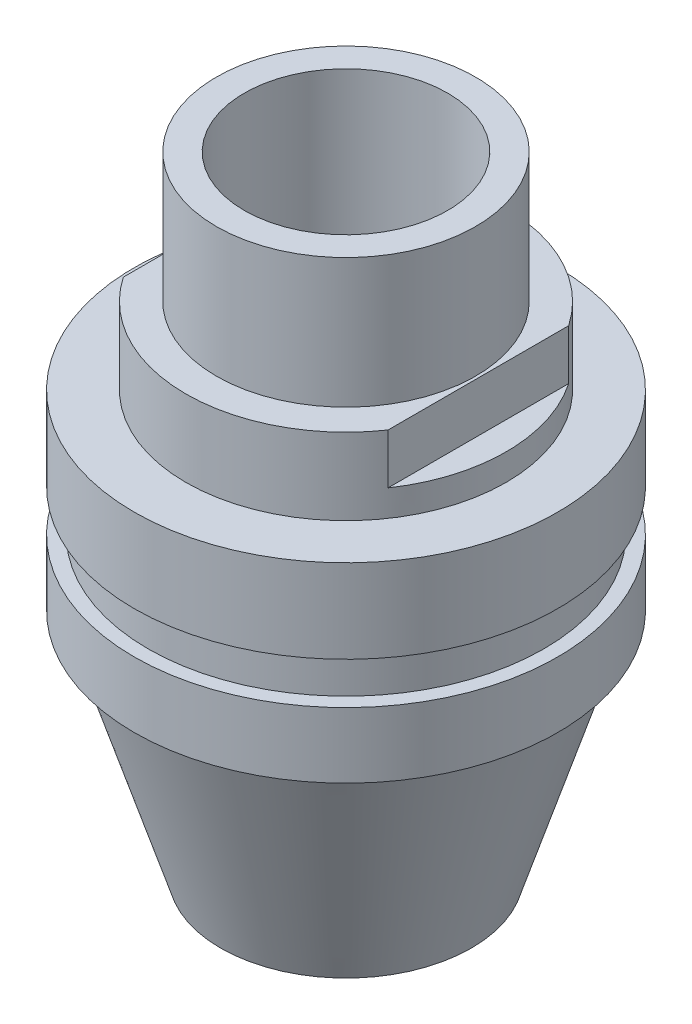
ISO-10303-21;
HEADER;
FILE_DESCRIPTION(('STEP AP214'),'2;1');
FILE_NAME('part.step','',(''),(''),'','','');
FILE_SCHEMA(('AUTOMOTIVE_DESIGN { 1 0 10303 214 1 1 1 1 }'));
ENDSEC;
DATA;
#1=APPLICATION_CONTEXT('core data for automotive mechanical design processes');
#2=APPLICATION_PROTOCOL_DEFINITION('international standard','automotive_design',2000,#1);
#3=PRODUCT_CONTEXT('',#1,'mechanical');
#4=PRODUCT('Part','Part','',(#3));
#5=PRODUCT_RELATED_PRODUCT_CATEGORY('part','',(#4));
#6=PRODUCT_DEFINITION_FORMATION('','',#4);
#7=PRODUCT_DEFINITION_CONTEXT('part definition',#1,'design');
#8=PRODUCT_DEFINITION('design','',#6,#7);
#9=PRODUCT_DEFINITION_SHAPE('','',#8);
#10=(LENGTH_UNIT() NAMED_UNIT(*) SI_UNIT(.MILLI.,.METRE.));
#11=(NAMED_UNIT(*) PLANE_ANGLE_UNIT() SI_UNIT($,.RADIAN.));
#12=(NAMED_UNIT(*) SI_UNIT($,.STERADIAN.) SOLID_ANGLE_UNIT());
#13=UNCERTAINTY_MEASURE_WITH_UNIT(LENGTH_MEASURE(1.E-05),#10,'distance_accuracy_value','');
#14=(GEOMETRIC_REPRESENTATION_CONTEXT(3) GLOBAL_UNCERTAINTY_ASSIGNED_CONTEXT((#13)) GLOBAL_UNIT_ASSIGNED_CONTEXT((#10,
#11,#12)) REPRESENTATION_CONTEXT('',''));
#15=CARTESIAN_POINT('',(0.,0.,0.));
#16=DIRECTION('',(0.,0.,1.));
#17=DIRECTION('',(1.,0.,0.));
#18=AXIS2_PLACEMENT_3D('',#15,#16,#17);
#19=CARTESIAN_POINT('',(0.,0.,0.));
#20=DIRECTION('',(0.,-1.,0.));
#21=DIRECTION('',(0.,0.,-1.));
#22=AXIS2_PLACEMENT_3D('',#19,#20,#21);
#23=PLANE('',#22);
#24=CARTESIAN_POINT('',(0.,0.,0.));
#25=DIRECTION('',(0.,1.,0.));
#26=DIRECTION('',(0.,0.,1.));
#27=AXIS2_PLACEMENT_3D('',#24,#25,#26);
#28=CIRCLE('',#27,4.65);
#29=CARTESIAN_POINT('',(0.,0.,4.65));
#30=VERTEX_POINT('',#29);
#31=EDGE_CURVE('E11',#30,#30,#28,.T.);
#32=ORIENTED_EDGE('',*,*,#31,.T.);
#33=EDGE_LOOP('',(#32));
#34=FACE_BOUND('',#33,.T.);
#35=CARTESIAN_POINT('',(0.,0.,0.));
#36=DIRECTION('',(0.,-1.,0.));
#37=DIRECTION('',(0.,0.,-1.));
#38=AXIS2_PLACEMENT_3D('',#35,#36,#37);
#39=CIRCLE('',#38,3.65);
#40=CARTESIAN_POINT('',(0.,0.,-3.65));
#41=VERTEX_POINT('',#40);
#42=EDGE_CURVE('E127',#41,#41,#39,.F.);
#43=ORIENTED_EDGE('',*,*,#42,.F.);
#44=EDGE_LOOP('',(#43));
#45=FACE_BOUND('',#44,.T.);
#46=ADVANCED_FACE('F32',(#34,#45),#23,.F.);
#47=CARTESIAN_POINT('',(4.65,-4.65,0.));
#48=DIRECTION('',(0.,-1.,0.));
#49=DIRECTION('',(0.,0.,-1.));
#50=AXIS2_PLACEMENT_3D('',#47,#48,#49);
#51=PLANE('',#50);
#52=CARTESIAN_POINT('',(0.,-4.65,0.));
#53=DIRECTION('',(0.,1.,0.));
#54=DIRECTION('',(0.,0.,1.));
#55=AXIS2_PLACEMENT_3D('',#52,#53,#54);
#56=CIRCLE('',#55,4.65);
#57=CARTESIAN_POINT('',(0.,-4.65,4.65));
#58=VERTEX_POINT('',#57);
#59=EDGE_CURVE('E40',#58,#58,#56,.T.);
#60=ORIENTED_EDGE('',*,*,#59,.F.);
#61=EDGE_LOOP('',(#60));
#62=FACE_BOUND('',#61,.T.);
#63=CARTESIAN_POINT('',(0.,-4.65,0.));
#64=DIRECTION('',(0.,1.,0.));
#65=DIRECTION('',(0.,0.,1.));
#66=AXIS2_PLACEMENT_3D('',#63,#64,#65);
#67=CIRCLE('',#66,5.75);
#68=CARTESIAN_POINT('',(-4.75,-4.65,3.24037034920393));
#69=VERTEX_POINT('',#68);
#70=CARTESIAN_POINT('',(4.75,-4.65,3.24037034920393));
#71=VERTEX_POINT('',#70);
#72=EDGE_CURVE('E219',#69,#71,#67,.T.);
#73=ORIENTED_EDGE('',*,*,#72,.T.);
#74=DIRECTION('',(0.,0.,1.));
#75=VECTOR('',#74,1.);
#76=CARTESIAN_POINT('',(4.75,-4.65,0.));
#77=LINE('',#76,#75);
#78=CARTESIAN_POINT('',(4.75,-4.65,-3.24037034920393));
#79=VERTEX_POINT('',#78);
#80=EDGE_CURVE('E170',#79,#71,#77,.T.);
#81=ORIENTED_EDGE('',*,*,#80,.F.);
#82=CARTESIAN_POINT('',(-4.75,-4.65,-3.24037034920393));
#83=VERTEX_POINT('',#82);
#84=EDGE_CURVE('E218',#79,#83,#67,.T.);
#85=ORIENTED_EDGE('',*,*,#84,.T.);
#86=DIRECTION('',(0.,0.,1.));
#87=VECTOR('',#86,1.);
#88=CARTESIAN_POINT('',(-4.75,-4.65,0.));
#89=LINE('',#88,#87);
#90=EDGE_CURVE('E179',#83,#69,#89,.T.);
#91=ORIENTED_EDGE('',*,*,#90,.T.);
#92=EDGE_LOOP('',(#73,#81,#85,#91));
#93=FACE_BOUND('',#92,.T.);
#94=ADVANCED_FACE('F227',(#62,#93),#51,.F.);
#95=CARTESIAN_POINT('',(0.,0.,0.));
#96=DIRECTION('',(0.,1.,0.));
#97=DIRECTION('',(0.,0.,1.));
#98=AXIS2_PLACEMENT_3D('',#95,#96,#97);
#99=CYLINDRICAL_SURFACE('',#98,5.75);
#100=CARTESIAN_POINT('',(0.,-7.4,0.));
#101=DIRECTION('',(0.,1.,0.));
#102=DIRECTION('',(0.,0.,1.));
#103=AXIS2_PLACEMENT_3D('',#100,#101,#102);
#104=CIRCLE('',#103,5.75);
#105=CARTESIAN_POINT('',(0.,-7.4,5.75));
#106=VERTEX_POINT('',#105);
#107=EDGE_CURVE('E215',#106,#106,#104,.T.);
#108=ORIENTED_EDGE('',*,*,#107,.T.);
#109=EDGE_LOOP('',(#108));
#110=FACE_BOUND('',#109,.T.);
#111=CARTESIAN_POINT('',(0.,-6.45,0.));
#112=DIRECTION('',(0.,1.,0.));
#113=DIRECTION('',(0.,0.,1.));
#114=AXIS2_PLACEMENT_3D('',#111,#112,#113);
#115=CIRCLE('',#114,5.75);
#116=CARTESIAN_POINT('',(4.75,-6.45,3.24037034920393));
#117=VERTEX_POINT('',#116);
#118=CARTESIAN_POINT('',(4.75,-6.45,-3.24037034920393));
#119=VERTEX_POINT('',#118);
#120=EDGE_CURVE('E171',#117,#119,#115,.T.);
#121=ORIENTED_EDGE('',*,*,#120,.F.);
#122=DIRECTION('',(0.,1.,0.));
#123=VECTOR('',#122,1.);
#124=CARTESIAN_POINT('',(4.75,-6.45,3.24037034920393));
#125=LINE('',#124,#123);
#126=EDGE_CURVE('E176',#117,#71,#125,.T.);
#127=ORIENTED_EDGE('',*,*,#126,.T.);
#128=ORIENTED_EDGE('',*,*,#72,.F.);
#129=DIRECTION('',(0.,1.,0.));
#130=VECTOR('',#129,1.);
#131=CARTESIAN_POINT('',(-4.75,-6.45,3.24037034920393));
#132=LINE('',#131,#130);
#133=CARTESIAN_POINT('',(-4.75,-6.45,3.24037034920393));
#134=VERTEX_POINT('',#133);
#135=EDGE_CURVE('E187',#134,#69,#132,.T.);
#136=ORIENTED_EDGE('',*,*,#135,.F.);
#137=CARTESIAN_POINT('',(0.,-6.45,0.));
#138=DIRECTION('',(0.,1.,0.));
#139=DIRECTION('',(0.,0.,1.));
#140=AXIS2_PLACEMENT_3D('',#137,#138,#139);
#141=CIRCLE('',#140,5.75);
#142=CARTESIAN_POINT('',(-4.75,-6.45,-3.24037034920393));
#143=VERTEX_POINT('',#142);
#144=EDGE_CURVE('E182',#143,#134,#141,.T.);
#145=ORIENTED_EDGE('',*,*,#144,.F.);
#146=DIRECTION('',(0.,1.,0.));
#147=VECTOR('',#146,1.);
#148=CARTESIAN_POINT('',(-4.75,-6.45,-3.24037034920393));
#149=LINE('',#148,#147);
#150=EDGE_CURVE('E184',#143,#83,#149,.T.);
#151=ORIENTED_EDGE('',*,*,#150,.T.);
#152=ORIENTED_EDGE('',*,*,#84,.F.);
#153=DIRECTION('',(0.,1.,0.));
#154=VECTOR('',#153,1.);
#155=CARTESIAN_POINT('',(4.75,-6.45,-3.24037034920393));
#156=LINE('',#155,#154);
#157=EDGE_CURVE('E174',#119,#79,#156,.T.);
#158=ORIENTED_EDGE('',*,*,#157,.F.);
#159=EDGE_LOOP('',(#121,#127,#128,#136,#145,#151,#152,#158));
#160=FACE_BOUND('',#159,.T.);
#161=ADVANCED_FACE('F230',(#110,#160),#99,.T.);
#162=CARTESIAN_POINT('',(0.,0.,0.));
#163=DIRECTION('',(0.,1.,0.));
#164=DIRECTION('',(0.,0.,1.));
#165=AXIS2_PLACEMENT_3D('',#162,#163,#164);
#166=CYLINDRICAL_SURFACE('',#165,4.65);
#167=ORIENTED_EDGE('',*,*,#31,.F.);
#168=EDGE_LOOP('',(#167));
#169=FACE_BOUND('',#168,.T.);
#170=ORIENTED_EDGE('',*,*,#59,.T.);
#171=EDGE_LOOP('',(#170));
#172=FACE_BOUND('',#171,.T.);
#173=ADVANCED_FACE('F225',(#169,#172),#166,.T.);
#174=CARTESIAN_POINT('',(5.75,-7.4,0.));
#175=DIRECTION('',(0.,-1.,0.));
#176=DIRECTION('',(0.,0.,-1.));
#177=AXIS2_PLACEMENT_3D('',#174,#175,#176);
#178=PLANE('',#177);
#179=ORIENTED_EDGE('',*,*,#107,.F.);
#180=EDGE_LOOP('',(#179));
#181=FACE_BOUND('',#180,.T.);
#182=CARTESIAN_POINT('',(0.,-7.4,0.));
#183=DIRECTION('',(0.,1.,0.));
#184=DIRECTION('',(0.,0.,1.));
#185=AXIS2_PLACEMENT_3D('',#182,#183,#184);
#186=CIRCLE('',#185,7.6);
#187=CARTESIAN_POINT('',(0.,-7.4,7.6));
#188=VERTEX_POINT('',#187);
#189=EDGE_CURVE('E212',#188,#188,#186,.T.);
#190=ORIENTED_EDGE('',*,*,#189,.T.);
#191=EDGE_LOOP('',(#190));
#192=FACE_BOUND('',#191,.T.);
#193=ADVANCED_FACE('F378',(#181,#192),#178,.F.);
#194=CARTESIAN_POINT('',(0.,0.,0.));
#195=DIRECTION('',(0.,1.,0.));
#196=DIRECTION('',(0.,0.,1.));
#197=AXIS2_PLACEMENT_3D('',#194,#195,#196);
#198=CYLINDRICAL_SURFACE('',#197,7.6);
#199=ORIENTED_EDGE('',*,*,#189,.F.);
#200=EDGE_LOOP('',(#199));
#201=FACE_BOUND('',#200,.T.);
#202=CARTESIAN_POINT('',(0.,-10.4,0.));
#203=DIRECTION('',(0.,1.,0.));
#204=DIRECTION('',(0.,0.,1.));
#205=AXIS2_PLACEMENT_3D('',#202,#203,#204);
#206=CIRCLE('',#205,7.6);
#207=CARTESIAN_POINT('',(0.,-10.4,7.6));
#208=VERTEX_POINT('',#207);
#209=EDGE_CURVE('E209',#208,#208,#206,.T.);
#210=ORIENTED_EDGE('',*,*,#209,.T.);
#211=EDGE_LOOP('',(#210));
#212=FACE_BOUND('',#211,.T.);
#213=ADVANCED_FACE('F374',(#201,#212),#198,.T.);
#214=CARTESIAN_POINT('',(7.6,-10.4,0.));
#215=DIRECTION('',(0.,1.,0.));
#216=DIRECTION('',(0.,0.,1.));
#217=AXIS2_PLACEMENT_3D('',#214,#215,#216);
#218=PLANE('',#217);
#219=ORIENTED_EDGE('',*,*,#209,.F.);
#220=EDGE_LOOP('',(#219));
#221=FACE_BOUND('',#220,.T.);
#222=CARTESIAN_POINT('',(0.,-10.4,0.));
#223=DIRECTION('',(0.,1.,0.));
#224=DIRECTION('',(0.,0.,1.));
#225=AXIS2_PLACEMENT_3D('',#222,#223,#224);
#226=CIRCLE('',#225,7.1);
#227=CARTESIAN_POINT('',(0.,-10.4,7.1));
#228=VERTEX_POINT('',#227);
#229=EDGE_CURVE('E206',#228,#228,#226,.T.);
#230=ORIENTED_EDGE('',*,*,#229,.T.);
#231=EDGE_LOOP('',(#230));
#232=FACE_BOUND('',#231,.T.);
#233=ADVANCED_FACE('F370',(#221,#232),#218,.F.);
#234=CARTESIAN_POINT('',(0.,0.,0.));
#235=DIRECTION('',(0.,1.,0.));
#236=DIRECTION('',(0.,0.,1.));
#237=AXIS2_PLACEMENT_3D('',#234,#235,#236);
#238=CYLINDRICAL_SURFACE('',#237,7.1);
#239=ORIENTED_EDGE('',*,*,#229,.F.);
#240=EDGE_LOOP('',(#239));
#241=FACE_BOUND('',#240,.T.);
#242=CARTESIAN_POINT('',(0.,-11.9,0.));
#243=DIRECTION('',(0.,1.,0.));
#244=DIRECTION('',(0.,0.,1.));
#245=AXIS2_PLACEMENT_3D('',#242,#243,#244);
#246=CIRCLE('',#245,7.1);
#247=CARTESIAN_POINT('',(0.,-11.9,7.1));
#248=VERTEX_POINT('',#247);
#249=EDGE_CURVE('E203',#248,#248,#246,.T.);
#250=ORIENTED_EDGE('',*,*,#249,.T.);
#251=EDGE_LOOP('',(#250));
#252=FACE_BOUND('',#251,.T.);
#253=ADVANCED_FACE('F366',(#241,#252),#238,.T.);
#254=CARTESIAN_POINT('',(7.1,-11.9,0.));
#255=DIRECTION('',(0.,-1.,0.));
#256=DIRECTION('',(0.,0.,-1.));
#257=AXIS2_PLACEMENT_3D('',#254,#255,#256);
#258=PLANE('',#257);
#259=ORIENTED_EDGE('',*,*,#249,.F.);
#260=EDGE_LOOP('',(#259));
#261=FACE_BOUND('',#260,.T.);
#262=CARTESIAN_POINT('',(0.,-11.9,0.));
#263=DIRECTION('',(0.,1.,0.));
#264=DIRECTION('',(0.,0.,1.));
#265=AXIS2_PLACEMENT_3D('',#262,#263,#264);
#266=CIRCLE('',#265,7.6);
#267=CARTESIAN_POINT('',(0.,-11.9,7.6));
#268=VERTEX_POINT('',#267);
#269=EDGE_CURVE('E200',#268,#268,#266,.T.);
#270=ORIENTED_EDGE('',*,*,#269,.T.);
#271=EDGE_LOOP('',(#270));
#272=FACE_BOUND('',#271,.T.);
#273=ADVANCED_FACE('F362',(#261,#272),#258,.F.);
#274=CARTESIAN_POINT('',(0.,0.,0.));
#275=DIRECTION('',(0.,1.,0.));
#276=DIRECTION('',(0.,0.,1.));
#277=AXIS2_PLACEMENT_3D('',#274,#275,#276);
#278=CYLINDRICAL_SURFACE('',#277,7.6);
#279=ORIENTED_EDGE('',*,*,#269,.F.);
#280=EDGE_LOOP('',(#279));
#281=FACE_BOUND('',#280,.T.);
#282=CARTESIAN_POINT('',(0.,-14.25,0.));
#283=DIRECTION('',(0.,1.,0.));
#284=DIRECTION('',(0.,0.,1.));
#285=AXIS2_PLACEMENT_3D('',#282,#283,#284);
#286=CIRCLE('',#285,7.6);
#287=CARTESIAN_POINT('',(0.,-14.25,7.6));
#288=VERTEX_POINT('',#287);
#289=EDGE_CURVE('E197',#288,#288,#286,.T.);
#290=ORIENTED_EDGE('',*,*,#289,.T.);
#291=EDGE_LOOP('',(#290));
#292=FACE_BOUND('',#291,.T.);
#293=ADVANCED_FACE('F355',(#281,#292),#278,.T.);
#294=CARTESIAN_POINT('',(7.6,-14.25,0.));
#295=DIRECTION('',(0.,1.,0.));
#296=DIRECTION('',(0.,0.,1.));
#297=AXIS2_PLACEMENT_3D('',#294,#295,#296);
#298=PLANE('',#297);
#299=ORIENTED_EDGE('',*,*,#289,.F.);
#300=EDGE_LOOP('',(#299));
#301=FACE_BOUND('',#300,.T.);
#302=CARTESIAN_POINT('',(0.,-14.25,0.));
#303=DIRECTION('',(0.,1.,0.));
#304=DIRECTION('',(0.,0.,1.));
#305=AXIS2_PLACEMENT_3D('',#302,#303,#304);
#306=CIRCLE('',#305,7.1);
#307=CARTESIAN_POINT('',(0.,-14.25,7.1));
#308=VERTEX_POINT('',#307);
#309=EDGE_CURVE('E194',#308,#308,#306,.T.);
#310=ORIENTED_EDGE('',*,*,#309,.T.);
#311=EDGE_LOOP('',(#310));
#312=FACE_BOUND('',#311,.T.);
#313=ADVANCED_FACE('F349',(#301,#312),#298,.F.);
#314=CARTESIAN_POINT('',(0.,-22.5,0.));
#315=DIRECTION('',(0.,1.,0.));
#316=DIRECTION('',(0.,0.,1.));
#317=AXIS2_PLACEMENT_3D('',#314,#315,#316);
#318=CONICAL_SURFACE('',#317,4.5,0.30529865679053);
#319=ORIENTED_EDGE('',*,*,#309,.F.);
#320=EDGE_LOOP('',(#319));
#321=FACE_BOUND('',#320,.T.);
#322=CARTESIAN_POINT('',(0.,-22.5,0.));
#323=DIRECTION('',(0.,1.,0.));
#324=DIRECTION('',(0.,0.,1.));
#325=AXIS2_PLACEMENT_3D('',#322,#323,#324);
#326=CIRCLE('',#325,4.5);
#327=CARTESIAN_POINT('',(0.,-22.5,4.5));
#328=VERTEX_POINT('',#327);
#329=EDGE_CURVE('E189',#328,#328,#326,.T.);
#330=ORIENTED_EDGE('',*,*,#329,.T.);
#331=EDGE_LOOP('',(#330));
#332=FACE_BOUND('',#331,.T.);
#333=ADVANCED_FACE('F344',(#321,#332),#318,.T.);
#334=CARTESIAN_POINT('',(4.5,-22.5,0.));
#335=DIRECTION('',(0.,1.,0.));
#336=DIRECTION('',(0.,0.,1.));
#337=AXIS2_PLACEMENT_3D('',#334,#335,#336);
#338=PLANE('',#337);
#339=CARTESIAN_POINT('',(0.,-22.5,0.));
#340=DIRECTION('',(0.,1.,0.));
#341=DIRECTION('',(0.,0.,1.));
#342=AXIS2_PLACEMENT_3D('',#339,#340,#341);
#343=CIRCLE('',#342,3.76666666666667);
#344=CARTESIAN_POINT('',(0.,-22.5,3.76666666666667));
#345=VERTEX_POINT('',#344);
#346=EDGE_CURVE('E35',#345,#345,#343,.T.);
#347=ORIENTED_EDGE('',*,*,#346,.T.);
#348=EDGE_LOOP('',(#347));
#349=FACE_BOUND('',#348,.T.);
#350=ORIENTED_EDGE('',*,*,#329,.F.);
#351=EDGE_LOOP('',(#350));
#352=FACE_BOUND('',#351,.T.);
#353=ADVANCED_FACE('F254',(#349,#352),#338,.F.);
#354=CARTESIAN_POINT('',(-4.75,-6.45,0.));
#355=DIRECTION('',(-1.,0.,0.));
#356=DIRECTION('',(0.,0.,1.));
#357=AXIS2_PLACEMENT_3D('',#354,#355,#356);
#358=PLANE('',#357);
#359=ORIENTED_EDGE('',*,*,#90,.F.);
#360=ORIENTED_EDGE('',*,*,#150,.F.);
#361=DIRECTION('',(0.,0.,1.));
#362=VECTOR('',#361,1.);
#363=CARTESIAN_POINT('',(-4.75,-6.45,0.));
#364=LINE('',#363,#362);
#365=EDGE_CURVE('E53',#143,#134,#364,.T.);
#366=ORIENTED_EDGE('',*,*,#365,.T.);
#367=ORIENTED_EDGE('',*,*,#135,.T.);
#368=EDGE_LOOP('',(#359,#360,#366,#367));
#369=FACE_BOUND('',#368,.T.);
#370=ADVANCED_FACE('F244',(#369),#358,.T.);
#371=CARTESIAN_POINT('',(0.,-6.45,0.));
#372=DIRECTION('',(0.,1.,0.));
#373=DIRECTION('',(0.,0.,1.));
#374=AXIS2_PLACEMENT_3D('',#371,#372,#373);
#375=PLANE('',#374);
#376=ORIENTED_EDGE('',*,*,#365,.F.);
#377=ORIENTED_EDGE('',*,*,#144,.T.);
#378=EDGE_LOOP('',(#376,#377));
#379=FACE_BOUND('',#378,.T.);
#380=ADVANCED_FACE('F245',(#379),#375,.T.);
#381=CARTESIAN_POINT('',(4.75,-6.45,0.));
#382=DIRECTION('',(-1.,0.,0.));
#383=DIRECTION('',(0.,0.,1.));
#384=AXIS2_PLACEMENT_3D('',#381,#382,#383);
#385=PLANE('',#384);
#386=ORIENTED_EDGE('',*,*,#80,.T.);
#387=ORIENTED_EDGE('',*,*,#126,.F.);
#388=DIRECTION('',(0.,0.,1.));
#389=VECTOR('',#388,1.);
#390=CARTESIAN_POINT('',(4.75,-6.45,0.));
#391=LINE('',#390,#389);
#392=EDGE_CURVE('E46',#119,#117,#391,.T.);
#393=ORIENTED_EDGE('',*,*,#392,.F.);
#394=ORIENTED_EDGE('',*,*,#157,.T.);
#395=EDGE_LOOP('',(#386,#387,#393,#394));
#396=FACE_BOUND('',#395,.T.);
#397=ADVANCED_FACE('F242',(#396),#385,.F.);
#398=CARTESIAN_POINT('',(0.,-6.45,0.));
#399=DIRECTION('',(0.,1.,0.));
#400=DIRECTION('',(0.,0.,1.));
#401=AXIS2_PLACEMENT_3D('',#398,#399,#400);
#402=PLANE('',#401);
#403=ORIENTED_EDGE('',*,*,#120,.T.);
#404=ORIENTED_EDGE('',*,*,#392,.T.);
#405=EDGE_LOOP('',(#403,#404));
#406=FACE_BOUND('',#405,.T.);
#407=ADVANCED_FACE('F252',(#406),#402,.T.);
#408=CARTESIAN_POINT('',(4.65,-5.65,0.));
#409=DIRECTION('',(0.,-1.,0.));
#410=DIRECTION('',(0.,0.,-1.));
#411=AXIS2_PLACEMENT_3D('',#408,#409,#410);
#412=PLANE('',#411);
#413=CARTESIAN_POINT('',(0.,-5.65,0.));
#414=DIRECTION('',(0.,-1.,0.));
#415=DIRECTION('',(0.,0.,-1.));
#416=AXIS2_PLACEMENT_3D('',#413,#414,#415);
#417=CIRCLE('',#416,3.65);
#418=CARTESIAN_POINT('',(0.,-5.65,-3.65));
#419=VERTEX_POINT('',#418);
#420=EDGE_CURVE('E124',#419,#419,#417,.F.);
#421=ORIENTED_EDGE('',*,*,#420,.T.);
#422=EDGE_LOOP('',(#421));
#423=FACE_BOUND('',#422,.T.);
#424=CARTESIAN_POINT('',(0.,-5.65,0.));
#425=DIRECTION('',(0.,-1.,0.));
#426=DIRECTION('',(0.,0.,-1.));
#427=AXIS2_PLACEMENT_3D('',#424,#425,#426);
#428=CIRCLE('',#427,4.75);
#429=CARTESIAN_POINT('',(-3.75,-5.65,2.91547594742265));
#430=VERTEX_POINT('',#429);
#431=CARTESIAN_POINT('',(3.75,-5.65,2.91547594742265));
#432=VERTEX_POINT('',#431);
#433=EDGE_CURVE('E103',#430,#432,#428,.F.);
#434=ORIENTED_EDGE('',*,*,#433,.F.);
#435=DIRECTION('',(0.,0.,1.));
#436=VECTOR('',#435,1.);
#437=CARTESIAN_POINT('',(-3.75,-5.65,0.));
#438=LINE('',#437,#436);
#439=CARTESIAN_POINT('',(-3.75,-5.65,-2.91547594742265));
#440=VERTEX_POINT('',#439);
#441=EDGE_CURVE('E116',#440,#430,#438,.T.);
#442=ORIENTED_EDGE('',*,*,#441,.F.);
#443=CARTESIAN_POINT('',(0.,-5.65,0.));
#444=DIRECTION('',(0.,-1.,0.));
#445=DIRECTION('',(0.,0.,-1.));
#446=AXIS2_PLACEMENT_3D('',#443,#444,#445);
#447=CIRCLE('',#446,4.75);
#448=CARTESIAN_POINT('',(3.75,-5.65,-2.91547594742265));
#449=VERTEX_POINT('',#448);
#450=EDGE_CURVE('E104',#449,#440,#447,.F.);
#451=ORIENTED_EDGE('',*,*,#450,.F.);
#452=DIRECTION('',(0.,0.,1.));
#453=VECTOR('',#452,1.);
#454=CARTESIAN_POINT('',(3.75,-5.65,0.));
#455=LINE('',#454,#453);
#456=EDGE_CURVE('E98',#449,#432,#455,.T.);
#457=ORIENTED_EDGE('',*,*,#456,.T.);
#458=EDGE_LOOP('',(#434,#442,#451,#457));
#459=FACE_BOUND('',#458,.T.);
#460=ADVANCED_FACE('F100',(#423,#459),#412,.T.);
#461=CARTESIAN_POINT('',(0.,0.,0.));
#462=DIRECTION('',(0.,1.,0.));
#463=DIRECTION('',(0.,0.,1.));
#464=AXIS2_PLACEMENT_3D('',#461,#462,#463);
#465=CYLINDRICAL_SURFACE('',#464,4.75);
#466=CARTESIAN_POINT('',(0.,-8.4,0.));
#467=DIRECTION('',(0.,-1.,0.));
#468=DIRECTION('',(0.,0.,-1.));
#469=AXIS2_PLACEMENT_3D('',#466,#467,#468);
#470=CIRCLE('',#469,4.75);
#471=CARTESIAN_POINT('',(0.,-8.4,-4.75));
#472=VERTEX_POINT('',#471);
#473=EDGE_CURVE('E129',#472,#472,#470,.F.);
#474=ORIENTED_EDGE('',*,*,#473,.F.);
#475=EDGE_LOOP('',(#474));
#476=FACE_BOUND('',#475,.T.);
#477=CARTESIAN_POINT('',(0.,-7.45,0.));
#478=DIRECTION('',(0.,1.,0.));
#479=DIRECTION('',(0.,0.,1.));
#480=AXIS2_PLACEMENT_3D('',#477,#478,#479);
#481=CIRCLE('',#480,4.75);
#482=CARTESIAN_POINT('',(3.75,-7.45,2.91547594742265));
#483=VERTEX_POINT('',#482);
#484=CARTESIAN_POINT('',(3.75,-7.45,-2.91547594742265));
#485=VERTEX_POINT('',#484);
#486=EDGE_CURVE('E107',#483,#485,#481,.T.);
#487=ORIENTED_EDGE('',*,*,#486,.T.);
#488=DIRECTION('',(0.,1.,0.));
#489=VECTOR('',#488,1.);
#490=CARTESIAN_POINT('',(3.75,-7.45,-2.91547594742265));
#491=LINE('',#490,#489);
#492=EDGE_CURVE('E117',#485,#449,#491,.T.);
#493=ORIENTED_EDGE('',*,*,#492,.T.);
#494=ORIENTED_EDGE('',*,*,#450,.T.);
#495=DIRECTION('',(0.,1.,0.));
#496=VECTOR('',#495,1.);
#497=CARTESIAN_POINT('',(-3.75,-7.45,-2.91547594742265));
#498=LINE('',#497,#496);
#499=CARTESIAN_POINT('',(-3.75,-7.45,-2.91547594742265));
#500=VERTEX_POINT('',#499);
#501=EDGE_CURVE('E141',#500,#440,#498,.T.);
#502=ORIENTED_EDGE('',*,*,#501,.F.);
#503=CARTESIAN_POINT('',(0.,-7.45,0.));
#504=DIRECTION('',(0.,1.,0.));
#505=DIRECTION('',(0.,0.,1.));
#506=AXIS2_PLACEMENT_3D('',#503,#504,#505);
#507=CIRCLE('',#506,4.75);
#508=CARTESIAN_POINT('',(-3.75,-7.45,2.91547594742265));
#509=VERTEX_POINT('',#508);
#510=EDGE_CURVE('E142',#500,#509,#507,.T.);
#511=ORIENTED_EDGE('',*,*,#510,.T.);
#512=DIRECTION('',(0.,1.,0.));
#513=VECTOR('',#512,1.);
#514=CARTESIAN_POINT('',(-3.75,-7.45,2.91547594742265));
#515=LINE('',#514,#513);
#516=EDGE_CURVE('E122',#509,#430,#515,.T.);
#517=ORIENTED_EDGE('',*,*,#516,.T.);
#518=ORIENTED_EDGE('',*,*,#433,.T.);
#519=DIRECTION('',(0.,1.,0.));
#520=VECTOR('',#519,1.);
#521=CARTESIAN_POINT('',(3.75,-7.45,2.91547594742265));
#522=LINE('',#521,#520);
#523=EDGE_CURVE('E110',#483,#432,#522,.T.);
#524=ORIENTED_EDGE('',*,*,#523,.F.);
#525=EDGE_LOOP('',(#487,#493,#494,#502,#511,#517,#518,#524));
#526=FACE_BOUND('',#525,.T.);
#527=ADVANCED_FACE('F119',(#476,#526),#465,.F.);
#528=CARTESIAN_POINT('',(0.,0.,0.));
#529=DIRECTION('',(0.,1.,0.));
#530=DIRECTION('',(0.,0.,1.));
#531=AXIS2_PLACEMENT_3D('',#528,#529,#530);
#532=CYLINDRICAL_SURFACE('',#531,3.65);
#533=ORIENTED_EDGE('',*,*,#42,.T.);
#534=EDGE_LOOP('',(#533));
#535=FACE_BOUND('',#534,.T.);
#536=ORIENTED_EDGE('',*,*,#420,.F.);
#537=EDGE_LOOP('',(#536));
#538=FACE_BOUND('',#537,.T.);
#539=ADVANCED_FACE('F264',(#535,#538),#532,.F.);
#540=CARTESIAN_POINT('',(5.75,-8.4,0.));
#541=DIRECTION('',(0.,-1.,0.));
#542=DIRECTION('',(0.,0.,-1.));
#543=AXIS2_PLACEMENT_3D('',#540,#541,#542);
#544=PLANE('',#543);
#545=ORIENTED_EDGE('',*,*,#473,.T.);
#546=EDGE_LOOP('',(#545));
#547=FACE_BOUND('',#546,.T.);
#548=CARTESIAN_POINT('',(0.,-8.4,0.));
#549=DIRECTION('',(0.,-1.,0.));
#550=DIRECTION('',(0.,0.,-1.));
#551=AXIS2_PLACEMENT_3D('',#548,#549,#550);
#552=CIRCLE('',#551,6.6);
#553=CARTESIAN_POINT('',(0.,-8.4,-6.6));
#554=VERTEX_POINT('',#553);
#555=EDGE_CURVE('E137',#554,#554,#552,.F.);
#556=ORIENTED_EDGE('',*,*,#555,.F.);
#557=EDGE_LOOP('',(#556));
#558=FACE_BOUND('',#557,.T.);
#559=ADVANCED_FACE('F267',(#547,#558),#544,.T.);
#560=CARTESIAN_POINT('',(0.,0.,0.));
#561=DIRECTION('',(0.,1.,0.));
#562=DIRECTION('',(0.,0.,1.));
#563=AXIS2_PLACEMENT_3D('',#560,#561,#562);
#564=CYLINDRICAL_SURFACE('',#563,6.6);
#565=ORIENTED_EDGE('',*,*,#555,.T.);
#566=EDGE_LOOP('',(#565));
#567=FACE_BOUND('',#566,.T.);
#568=CARTESIAN_POINT('',(0.,-9.4,0.));
#569=DIRECTION('',(0.,1.,0.));
#570=DIRECTION('',(0.,0.,1.));
#571=AXIS2_PLACEMENT_3D('',#568,#569,#570);
#572=CIRCLE('',#571,6.6);
#573=CARTESIAN_POINT('',(0.,-9.4,6.6));
#574=VERTEX_POINT('',#573);
#575=EDGE_CURVE('E149',#574,#574,#572,.T.);
#576=ORIENTED_EDGE('',*,*,#575,.F.);
#577=EDGE_LOOP('',(#576));
#578=FACE_BOUND('',#577,.T.);
#579=ADVANCED_FACE('F285',(#567,#578),#564,.F.);
#580=CARTESIAN_POINT('',(7.6,-9.4,0.));
#581=DIRECTION('',(0.,1.,0.));
#582=DIRECTION('',(0.,0.,1.));
#583=AXIS2_PLACEMENT_3D('',#580,#581,#582);
#584=PLANE('',#583);
#585=ORIENTED_EDGE('',*,*,#575,.T.);
#586=EDGE_LOOP('',(#585));
#587=FACE_BOUND('',#586,.T.);
#588=CARTESIAN_POINT('',(0.,-9.4,0.));
#589=DIRECTION('',(0.,1.,0.));
#590=DIRECTION('',(0.,0.,1.));
#591=AXIS2_PLACEMENT_3D('',#588,#589,#590);
#592=CIRCLE('',#591,6.1);
#593=CARTESIAN_POINT('',(0.,-9.4,6.1));
#594=VERTEX_POINT('',#593);
#595=EDGE_CURVE('E152',#594,#594,#592,.T.);
#596=ORIENTED_EDGE('',*,*,#595,.F.);
#597=EDGE_LOOP('',(#596));
#598=FACE_BOUND('',#597,.T.);
#599=ADVANCED_FACE('F289',(#587,#598),#584,.T.);
#600=CARTESIAN_POINT('',(0.,0.,0.));
#601=DIRECTION('',(0.,1.,0.));
#602=DIRECTION('',(0.,0.,1.));
#603=AXIS2_PLACEMENT_3D('',#600,#601,#602);
#604=CYLINDRICAL_SURFACE('',#603,6.1);
#605=ORIENTED_EDGE('',*,*,#595,.T.);
#606=EDGE_LOOP('',(#605));
#607=FACE_BOUND('',#606,.T.);
#608=CARTESIAN_POINT('',(0.,-12.9,0.));
#609=DIRECTION('',(0.,-1.,0.));
#610=DIRECTION('',(0.,0.,-1.));
#611=AXIS2_PLACEMENT_3D('',#608,#609,#610);
#612=CIRCLE('',#611,6.1);
#613=CARTESIAN_POINT('',(0.,-12.9,-6.1));
#614=VERTEX_POINT('',#613);
#615=EDGE_CURVE('E155',#614,#614,#612,.F.);
#616=ORIENTED_EDGE('',*,*,#615,.F.);
#617=EDGE_LOOP('',(#616));
#618=FACE_BOUND('',#617,.T.);
#619=ADVANCED_FACE('F293',(#607,#618),#604,.F.);
#620=CARTESIAN_POINT('',(7.1,-12.9,0.));
#621=DIRECTION('',(0.,-1.,0.));
#622=DIRECTION('',(0.,0.,-1.));
#623=AXIS2_PLACEMENT_3D('',#620,#621,#622);
#624=PLANE('',#623);
#625=ORIENTED_EDGE('',*,*,#615,.T.);
#626=EDGE_LOOP('',(#625));
#627=FACE_BOUND('',#626,.T.);
#628=CARTESIAN_POINT('',(0.,-12.9,0.));
#629=DIRECTION('',(0.,-1.,0.));
#630=DIRECTION('',(0.,0.,-1.));
#631=AXIS2_PLACEMENT_3D('',#628,#629,#630);
#632=CIRCLE('',#631,6.6);
#633=CARTESIAN_POINT('',(0.,-12.9,-6.6));
#634=VERTEX_POINT('',#633);
#635=EDGE_CURVE('E158',#634,#634,#632,.F.);
#636=ORIENTED_EDGE('',*,*,#635,.F.);
#637=EDGE_LOOP('',(#636));
#638=FACE_BOUND('',#637,.T.);
#639=ADVANCED_FACE('F297',(#627,#638),#624,.T.);
#640=CARTESIAN_POINT('',(0.,0.,0.));
#641=DIRECTION('',(0.,1.,0.));
#642=DIRECTION('',(0.,0.,1.));
#643=AXIS2_PLACEMENT_3D('',#640,#641,#642);
#644=CYLINDRICAL_SURFACE('',#643,6.6);
#645=ORIENTED_EDGE('',*,*,#635,.T.);
#646=EDGE_LOOP('',(#645));
#647=FACE_BOUND('',#646,.T.);
#648=CARTESIAN_POINT('',(0.,-13.25,0.));
#649=DIRECTION('',(0.,1.,0.));
#650=DIRECTION('',(0.,0.,1.));
#651=AXIS2_PLACEMENT_3D('',#648,#649,#650);
#652=CIRCLE('',#651,6.6);
#653=CARTESIAN_POINT('',(0.,-13.25,6.6));
#654=VERTEX_POINT('',#653);
#655=EDGE_CURVE('E161',#654,#654,#652,.T.);
#656=ORIENTED_EDGE('',*,*,#655,.F.);
#657=EDGE_LOOP('',(#656));
#658=FACE_BOUND('',#657,.T.);
#659=ADVANCED_FACE('F301',(#647,#658),#644,.F.);
#660=CARTESIAN_POINT('',(7.6,-13.25,0.));
#661=DIRECTION('',(0.,1.,0.));
#662=DIRECTION('',(0.,0.,1.));
#663=AXIS2_PLACEMENT_3D('',#660,#661,#662);
#664=PLANE('',#663);
#665=ORIENTED_EDGE('',*,*,#655,.T.);
#666=EDGE_LOOP('',(#665));
#667=FACE_BOUND('',#666,.T.);
#668=CARTESIAN_POINT('',(0.,-13.25,0.));
#669=DIRECTION('',(0.,1.,0.));
#670=DIRECTION('',(0.,0.,1.));
#671=AXIS2_PLACEMENT_3D('',#668,#669,#670);
#672=CIRCLE('',#671,6.36666666666667);
#673=CARTESIAN_POINT('',(0.,-13.25,6.36666666666667));
#674=VERTEX_POINT('',#673);
#675=EDGE_CURVE('E140',#674,#674,#672,.T.);
#676=ORIENTED_EDGE('',*,*,#675,.F.);
#677=EDGE_LOOP('',(#676));
#678=FACE_BOUND('',#677,.T.);
#679=ADVANCED_FACE('F305',(#667,#678),#664,.T.);
#680=CARTESIAN_POINT('',(0.,-22.1994219653179,0.));
#681=DIRECTION('',(0.,1.,0.));
#682=DIRECTION('',(0.,0.,1.));
#683=AXIS2_PLACEMENT_3D('',#680,#681,#682);
#684=CONICAL_SURFACE('',#683,3.54624277456648,0.30529865679053);
#685=ORIENTED_EDGE('',*,*,#675,.T.);
#686=EDGE_LOOP('',(#685));
#687=FACE_BOUND('',#686,.T.);
#688=CARTESIAN_POINT('',(0.,-21.5,0.));
#689=DIRECTION('',(0.,1.,0.));
#690=DIRECTION('',(0.,0.,1.));
#691=AXIS2_PLACEMENT_3D('',#688,#689,#690);
#692=CIRCLE('',#691,3.76666666666667);
#693=CARTESIAN_POINT('',(0.,-21.5,3.76666666666667));
#694=VERTEX_POINT('',#693);
#695=EDGE_CURVE('E338',#694,#694,#692,.T.);
#696=ORIENTED_EDGE('',*,*,#695,.F.);
#697=EDGE_LOOP('',(#696));
#698=FACE_BOUND('',#697,.T.);
#699=ADVANCED_FACE('F309',(#687,#698),#684,.F.);
#700=CARTESIAN_POINT('',(-3.75,-6.45,0.));
#701=DIRECTION('',(-1.,0.,0.));
#702=DIRECTION('',(0.,0.,1.));
#703=AXIS2_PLACEMENT_3D('',#700,#701,#702);
#704=PLANE('',#703);
#705=ORIENTED_EDGE('',*,*,#441,.T.);
#706=ORIENTED_EDGE('',*,*,#516,.F.);
#707=DIRECTION('',(0.,0.,1.));
#708=VECTOR('',#707,1.);
#709=CARTESIAN_POINT('',(-3.75,-7.45,0.));
#710=LINE('',#709,#708);
#711=EDGE_CURVE('E134',#500,#509,#710,.T.);
#712=ORIENTED_EDGE('',*,*,#711,.F.);
#713=ORIENTED_EDGE('',*,*,#501,.T.);
#714=EDGE_LOOP('',(#705,#706,#712,#713));
#715=FACE_BOUND('',#714,.T.);
#716=ADVANCED_FACE('F313',(#715),#704,.F.);
#717=CARTESIAN_POINT('',(0.,-7.45,0.));
#718=DIRECTION('',(0.,1.,0.));
#719=DIRECTION('',(0.,0.,1.));
#720=AXIS2_PLACEMENT_3D('',#717,#718,#719);
#721=PLANE('',#720);
#722=ORIENTED_EDGE('',*,*,#711,.T.);
#723=ORIENTED_EDGE('',*,*,#510,.F.);
#724=EDGE_LOOP('',(#722,#723));
#725=FACE_BOUND('',#724,.T.);
#726=ADVANCED_FACE('F317',(#725),#721,.F.);
#727=CARTESIAN_POINT('',(3.75,-6.45,0.));
#728=DIRECTION('',(-1.,0.,0.));
#729=DIRECTION('',(0.,0.,1.));
#730=AXIS2_PLACEMENT_3D('',#727,#728,#729);
#731=PLANE('',#730);
#732=ORIENTED_EDGE('',*,*,#456,.F.);
#733=ORIENTED_EDGE('',*,*,#492,.F.);
#734=DIRECTION('',(0.,0.,1.));
#735=VECTOR('',#734,1.);
#736=CARTESIAN_POINT('',(3.75,-7.45,0.));
#737=LINE('',#736,#735);
#738=EDGE_CURVE('E113',#485,#483,#737,.T.);
#739=ORIENTED_EDGE('',*,*,#738,.T.);
#740=ORIENTED_EDGE('',*,*,#523,.T.);
#741=EDGE_LOOP('',(#732,#733,#739,#740));
#742=FACE_BOUND('',#741,.T.);
#743=ADVANCED_FACE('F111',(#742),#731,.T.);
#744=CARTESIAN_POINT('',(0.,-7.45,0.));
#745=DIRECTION('',(0.,1.,0.));
#746=DIRECTION('',(0.,0.,1.));
#747=AXIS2_PLACEMENT_3D('',#744,#745,#746);
#748=PLANE('',#747);
#749=ORIENTED_EDGE('',*,*,#486,.F.);
#750=ORIENTED_EDGE('',*,*,#738,.F.);
#751=EDGE_LOOP('',(#749,#750));
#752=FACE_BOUND('',#751,.T.);
#753=ADVANCED_FACE('F324',(#752),#748,.F.);
#754=CARTESIAN_POINT('',(0.,-28.3,0.));
#755=DIRECTION('',(0.,1.,0.));
#756=DIRECTION('',(0.,0.,1.));
#757=AXIS2_PLACEMENT_3D('',#754,#755,#756);
#758=CYLINDRICAL_SURFACE('',#757,3.76666666666667);
#759=ORIENTED_EDGE('',*,*,#695,.T.);
#760=EDGE_LOOP('',(#759));
#761=FACE_BOUND('',#760,.T.);
#762=ORIENTED_EDGE('',*,*,#346,.F.);
#763=EDGE_LOOP('',(#762));
#764=FACE_BOUND('',#763,.T.);
#765=ADVANCED_FACE('F281',(#761,#764),#758,.F.);
#766=CLOSED_SHELL('',(#46,#94,#161,#173,#193,#213,#233,#253,#273,#293,#313,#333,#353,#370,#380,
#397,#407,#460,#527,#539,#559,#579,#599,#619,#639,#659,#679,#699,#716,#726,#743,#753,#765));
#767=MANIFOLD_SOLID_BREP('B2',#766);
#768=ADVANCED_BREP_SHAPE_REPRESENTATION('',(#18,#767),#14);
#769=SHAPE_DEFINITION_REPRESENTATION(#9,#768);
ENDSEC;
END-ISO-10303-21;
